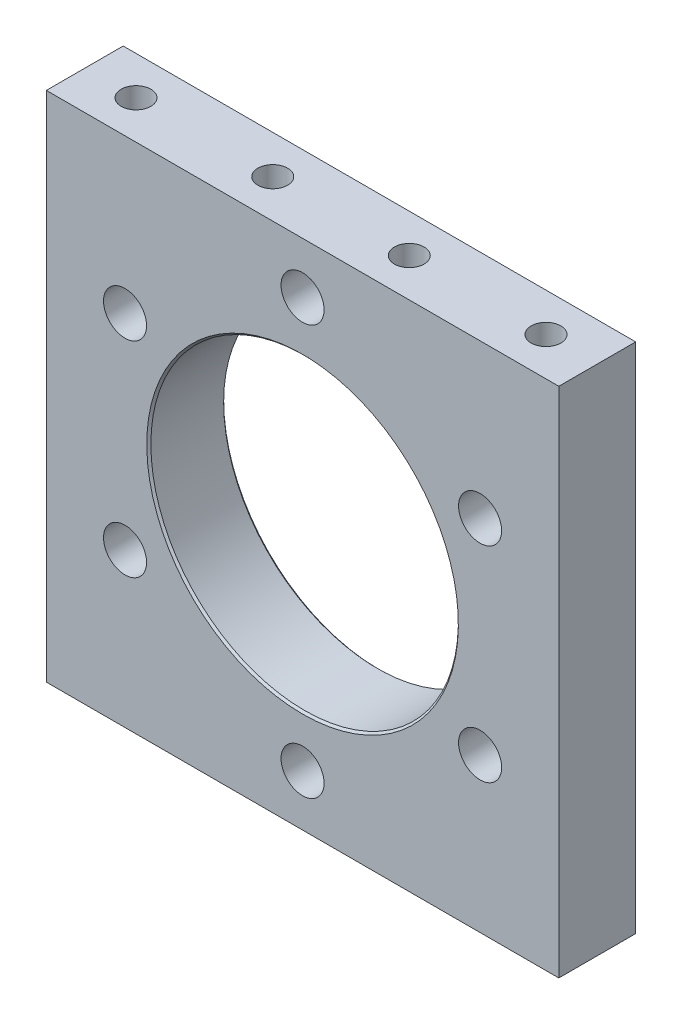
ISO-10303-21;
HEADER;
FILE_DESCRIPTION(('STEP AP214'),'2;1');
FILE_NAME('part.step','',(''),(''),'','','');
FILE_SCHEMA(('AUTOMOTIVE_DESIGN { 1 0 10303 214 1 1 1 1 }'));
ENDSEC;
DATA;
#1=APPLICATION_CONTEXT('core data for automotive mechanical design processes');
#2=APPLICATION_PROTOCOL_DEFINITION('international standard','automotive_design',2000,#1);
#3=PRODUCT_CONTEXT('',#1,'mechanical');
#4=PRODUCT('Part','Part','',(#3));
#5=PRODUCT_RELATED_PRODUCT_CATEGORY('part','',(#4));
#6=PRODUCT_DEFINITION_FORMATION('','',#4);
#7=PRODUCT_DEFINITION_CONTEXT('part definition',#1,'design');
#8=PRODUCT_DEFINITION('design','',#6,#7);
#9=PRODUCT_DEFINITION_SHAPE('','',#8);
#10=(LENGTH_UNIT() NAMED_UNIT(*) SI_UNIT(.MILLI.,.METRE.));
#11=(NAMED_UNIT(*) PLANE_ANGLE_UNIT() SI_UNIT($,.RADIAN.));
#12=(NAMED_UNIT(*) SI_UNIT($,.STERADIAN.) SOLID_ANGLE_UNIT());
#13=UNCERTAINTY_MEASURE_WITH_UNIT(LENGTH_MEASURE(1.E-05),#10,'distance_accuracy_value','');
#14=(GEOMETRIC_REPRESENTATION_CONTEXT(3) GLOBAL_UNCERTAINTY_ASSIGNED_CONTEXT((#13)) GLOBAL_UNIT_ASSIGNED_CONTEXT((#10,
#11,#12)) REPRESENTATION_CONTEXT('',''));
#15=CARTESIAN_POINT('',(0.,0.,0.));
#16=DIRECTION('',(0.,0.,1.));
#17=DIRECTION('',(1.,0.,0.));
#18=AXIS2_PLACEMENT_3D('',#15,#16,#17);
#19=CARTESIAN_POINT('',(8.28168607653656,42.2101294802246,4.7625));
#20=DIRECTION('',(0.,1.,0.));
#21=DIRECTION('',(0.,0.,1.));
#22=AXIS2_PLACEMENT_3D('',#19,#20,#21);
#23=CONICAL_SURFACE('',#22,1.84149999933648,1.02974425750932);
#24=CARTESIAN_POINT('',(8.28168607654334,41.1036446477624,4.7625));
#25=VERTEX_POINT('',#24);
#26=VERTEX_LOOP('',#25);
#27=FACE_BOUND('',#26,.T.);
#28=CARTESIAN_POINT('',(8.28168607653656,42.2101294791789,4.7625));
#29=DIRECTION('',(0.,1.,0.));
#30=DIRECTION('',(0.,0.,1.));
#31=AXIS2_PLACEMENT_3D('',#28,#29,#30);
#32=CIRCLE('',#31,1.8415);
#33=CARTESIAN_POINT('',(8.28168607653656,42.2101294791789,6.604));
#34=VERTEX_POINT('',#33);
#35=EDGE_CURVE('E84',#34,#34,#32,.T.);
#36=ORIENTED_EDGE('',*,*,#35,.T.);
#37=EDGE_LOOP('',(#36));
#38=FACE_BOUND('',#37,.T.);
#39=ADVANCED_FACE('F17',(#27,#38),#23,.F.);
#40=CARTESIAN_POINT('',(-8.63471392346345,42.2101294802246,4.7625));
#41=DIRECTION('',(0.,1.,0.));
#42=DIRECTION('',(0.,0.,1.));
#43=AXIS2_PLACEMENT_3D('',#40,#41,#42);
#44=CONICAL_SURFACE('',#43,1.84149999937962,1.02974425750932);
#45=CARTESIAN_POINT('',(-8.63471392341353,41.1036446477624,4.7625));
#46=VERTEX_POINT('',#45);
#47=VERTEX_LOOP('',#46);
#48=FACE_BOUND('',#47,.T.);
#49=CARTESIAN_POINT('',(-8.63471392346345,42.2101294791789,4.7625));
#50=DIRECTION('',(0.,1.,0.));
#51=DIRECTION('',(0.,0.,1.));
#52=AXIS2_PLACEMENT_3D('',#49,#50,#51);
#53=CIRCLE('',#52,1.8415);
#54=CARTESIAN_POINT('',(-8.63471392346345,42.2101294791789,6.604));
#55=VERTEX_POINT('',#54);
#56=EDGE_CURVE('E86',#55,#55,#53,.T.);
#57=ORIENTED_EDGE('',*,*,#56,.T.);
#58=EDGE_LOOP('',(#57));
#59=FACE_BOUND('',#58,.T.);
#60=ADVANCED_FACE('F81',(#48,#59),#44,.F.);
#61=CARTESIAN_POINT('',(-25.5765139234635,42.2101294803383,4.7625));
#62=DIRECTION('',(0.,1.,0.));
#63=DIRECTION('',(0.,0.,1.));
#64=AXIS2_PLACEMENT_3D('',#61,#62,#63);
#65=CONICAL_SURFACE('',#64,1.84149999945278,1.02974425750932);
#66=CARTESIAN_POINT('',(-25.5765139233404,41.1036446478761,4.7625));
#67=VERTEX_POINT('',#66);
#68=VERTEX_LOOP('',#67);
#69=FACE_BOUND('',#68,.T.);
#70=CARTESIAN_POINT('',(-25.5765139234635,42.2101294791789,4.7625));
#71=DIRECTION('',(0.,1.,0.));
#72=DIRECTION('',(0.,0.,1.));
#73=AXIS2_PLACEMENT_3D('',#70,#71,#72);
#74=CIRCLE('',#73,1.8415);
#75=CARTESIAN_POINT('',(-25.5765139234635,42.2101294791789,6.604));
#76=VERTEX_POINT('',#75);
#77=EDGE_CURVE('E89',#76,#76,#74,.T.);
#78=ORIENTED_EDGE('',*,*,#77,.T.);
#79=EDGE_LOOP('',(#78));
#80=FACE_BOUND('',#79,.T.);
#81=ADVANCED_FACE('F371',(#69,#80),#65,.F.);
#82=CARTESIAN_POINT('',(25.2234860765366,42.2101294802815,4.76249999999998));
#83=DIRECTION('',(0.,1.,0.));
#84=DIRECTION('',(0.,0.,1.));
#85=AXIS2_PLACEMENT_3D('',#82,#83,#84);
#86=CONICAL_SURFACE('',#85,1.84149999932016,1.02974425750017);
#87=CARTESIAN_POINT('',(25.2234860766407,41.1036446478761,4.76249999999998));
#88=VERTEX_POINT('',#87);
#89=VERTEX_LOOP('',#88);
#90=FACE_BOUND('',#89,.T.);
#91=CARTESIAN_POINT('',(25.2234860765366,42.2101294791789,4.76249999999998));
#92=DIRECTION('',(0.,1.,0.));
#93=DIRECTION('',(0.,0.,1.));
#94=AXIS2_PLACEMENT_3D('',#91,#92,#93);
#95=CIRCLE('',#94,1.8415);
#96=CARTESIAN_POINT('',(25.2234860765366,42.2101294791789,6.60399999999998));
#97=VERTEX_POINT('',#96);
#98=EDGE_CURVE('E200',#97,#97,#95,.T.);
#99=ORIENTED_EDGE('',*,*,#98,.T.);
#100=EDGE_LOOP('',(#99));
#101=FACE_BOUND('',#100,.T.);
#102=ADVANCED_FACE('F367',(#90,#101),#86,.F.);
#103=CARTESIAN_POINT('',(8.28168607653656,4.11012947807876,4.7625));
#104=DIRECTION('',(0.,-1.,0.));
#105=DIRECTION('',(0.,0.,-1.));
#106=AXIS2_PLACEMENT_3D('',#103,#104,#105);
#107=CONICAL_SURFACE('',#106,1.84149999933648,1.02974425750475);
#108=CARTESIAN_POINT('',(8.28168607665702,5.21661431048415,4.7625));
#109=VERTEX_POINT('',#108);
#110=VERTEX_LOOP('',#109);
#111=FACE_BOUND('',#110,.T.);
#112=CARTESIAN_POINT('',(8.28168607653656,4.11012947917888,4.7625));
#113=DIRECTION('',(0.,1.,0.));
#114=DIRECTION('',(0.,0.,1.));
#115=AXIS2_PLACEMENT_3D('',#112,#113,#114);
#116=CIRCLE('',#115,1.8415);
#117=CARTESIAN_POINT('',(8.28168607653656,4.11012947917888,6.604));
#118=VERTEX_POINT('',#117);
#119=EDGE_CURVE('E183',#118,#118,#116,.F.);
#120=ORIENTED_EDGE('',*,*,#119,.T.);
#121=EDGE_LOOP('',(#120));
#122=FACE_BOUND('',#121,.T.);
#123=ADVANCED_FACE('F363',(#111,#122),#107,.F.);
#124=CARTESIAN_POINT('',(-8.63471392346345,4.11012947807876,4.7625));
#125=DIRECTION('',(0.,-1.,0.));
#126=DIRECTION('',(0.,0.,-1.));
#127=AXIS2_PLACEMENT_3D('',#124,#125,#126);
#128=CONICAL_SURFACE('',#127,1.84149999937962,1.02974425744702);
#129=CARTESIAN_POINT('',(-8.63471392352722,5.21661431059783,4.7625));
#130=VERTEX_POINT('',#129);
#131=VERTEX_LOOP('',#130);
#132=FACE_BOUND('',#131,.T.);
#133=CARTESIAN_POINT('',(-8.63471392346345,4.11012947917888,4.7625));
#134=DIRECTION('',(0.,1.,0.));
#135=DIRECTION('',(0.,0.,1.));
#136=AXIS2_PLACEMENT_3D('',#133,#134,#135);
#137=CIRCLE('',#136,1.8415);
#138=CARTESIAN_POINT('',(-8.63471392346345,4.11012947917888,6.604));
#139=VERTEX_POINT('',#138);
#140=EDGE_CURVE('E218',#139,#139,#137,.F.);
#141=ORIENTED_EDGE('',*,*,#140,.T.);
#142=EDGE_LOOP('',(#141));
#143=FACE_BOUND('',#142,.T.);
#144=ADVANCED_FACE('F359',(#132,#143),#128,.F.);
#145=CARTESIAN_POINT('',(-25.5765139234635,4.1101294781356,4.7625));
#146=DIRECTION('',(0.,-1.,0.));
#147=DIRECTION('',(0.,0.,-1.));
#148=AXIS2_PLACEMENT_3D('',#145,#146,#147);
#149=CONICAL_SURFACE('',#148,1.8414999992254,1.02974425745932);
#150=CARTESIAN_POINT('',(-25.5765139235677,5.21661431059783,4.7625));
#151=VERTEX_POINT('',#150);
#152=VERTEX_LOOP('',#151);
#153=FACE_BOUND('',#152,.T.);
#154=CARTESIAN_POINT('',(-25.5765139234635,4.11012947917888,4.7625));
#155=DIRECTION('',(0.,1.,0.));
#156=DIRECTION('',(0.,0.,1.));
#157=AXIS2_PLACEMENT_3D('',#154,#155,#156);
#158=CIRCLE('',#157,1.8415);
#159=CARTESIAN_POINT('',(-25.5765139234635,4.11012947917888,6.604));
#160=VERTEX_POINT('',#159);
#161=EDGE_CURVE('E223',#160,#160,#158,.F.);
#162=ORIENTED_EDGE('',*,*,#161,.T.);
#163=EDGE_LOOP('',(#162));
#164=FACE_BOUND('',#163,.T.);
#165=ADVANCED_FACE('F352',(#153,#164),#149,.F.);
#166=CARTESIAN_POINT('',(25.2234860765366,4.1101294781356,4.76249999999998));
#167=DIRECTION('',(0.,-1.,0.));
#168=DIRECTION('',(0.,0.,-1.));
#169=AXIS2_PLACEMENT_3D('',#166,#167,#168);
#170=CONICAL_SURFACE('',#169,1.84149999926332,1.02974425750475);
#171=CARTESIAN_POINT('',(25.2234860765839,5.21661431054099,4.76249999999998));
#172=VERTEX_POINT('',#171);
#173=VERTEX_LOOP('',#172);
#174=FACE_BOUND('',#173,.T.);
#175=CARTESIAN_POINT('',(25.2234860765366,4.11012947917888,4.76249999999998));
#176=DIRECTION('',(0.,1.,0.));
#177=DIRECTION('',(0.,0.,1.));
#178=AXIS2_PLACEMENT_3D('',#175,#176,#177);
#179=CIRCLE('',#178,1.8415);
#180=CARTESIAN_POINT('',(25.2234860765366,4.11012947917888,6.60399999999998));
#181=VERTEX_POINT('',#180);
#182=EDGE_CURVE('E179',#181,#181,#179,.F.);
#183=ORIENTED_EDGE('',*,*,#182,.T.);
#184=EDGE_LOOP('',(#183));
#185=FACE_BOUND('',#184,.T.);
#186=ADVANCED_FACE('F343',(#174,#185),#170,.F.);
#187=CARTESIAN_POINT('',(-0.176513923463446,48.5601294791789,2.286));
#188=DIRECTION('',(0.,0.,-1.));
#189=DIRECTION('',(-1.,0.,0.));
#190=AXIS2_PLACEMENT_3D('',#187,#188,#189);
#191=CYLINDRICAL_SURFACE('',#190,4.7625);
#192=CARTESIAN_POINT('',(-0.176513923463446,48.5601294791789,4.572));
#193=DIRECTION('',(0.,0.,-1.));
#194=DIRECTION('',(-1.,0.,0.));
#195=AXIS2_PLACEMENT_3D('',#192,#193,#194);
#196=CIRCLE('',#195,4.7625);
#197=CARTESIAN_POINT('',(-4.93901392346345,48.5601294791789,4.572));
#198=VERTEX_POINT('',#197);
#199=EDGE_CURVE('E176',#198,#198,#196,.T.);
#200=ORIENTED_EDGE('',*,*,#199,.F.);
#201=EDGE_LOOP('',(#200));
#202=FACE_BOUND('',#201,.T.);
#203=CARTESIAN_POINT('',(-0.176513923463446,48.5601294791789,0.));
#204=DIRECTION('',(0.,0.,-1.));
#205=DIRECTION('',(-1.,0.,0.));
#206=AXIS2_PLACEMENT_3D('',#203,#204,#205);
#207=CIRCLE('',#206,4.7625);
#208=CARTESIAN_POINT('',(-4.93901392346345,48.5601294791789,0.));
#209=VERTEX_POINT('',#208);
#210=EDGE_CURVE('E20',#209,#209,#207,.T.);
#211=ORIENTED_EDGE('',*,*,#210,.T.);
#212=EDGE_LOOP('',(#211));
#213=FACE_BOUND('',#212,.T.);
#214=ADVANCED_FACE('F340',(#202,#213),#191,.F.);
#215=CARTESIAN_POINT('',(-22.1735591795882,35.8601294791789,2.286));
#216=DIRECTION('',(0.,0.,-1.));
#217=DIRECTION('',(-1.,0.,0.));
#218=AXIS2_PLACEMENT_3D('',#215,#216,#217);
#219=CYLINDRICAL_SURFACE('',#218,4.7625);
#220=CARTESIAN_POINT('',(-22.1735591795882,35.8601294791789,4.572));
#221=DIRECTION('',(0.,0.,-1.));
#222=DIRECTION('',(-1.,0.,0.));
#223=AXIS2_PLACEMENT_3D('',#220,#221,#222);
#224=CIRCLE('',#223,4.7625);
#225=CARTESIAN_POINT('',(-26.9360591795882,35.8601294791789,4.572));
#226=VERTEX_POINT('',#225);
#227=EDGE_CURVE('E173',#226,#226,#224,.T.);
#228=ORIENTED_EDGE('',*,*,#227,.F.);
#229=EDGE_LOOP('',(#228));
#230=FACE_BOUND('',#229,.T.);
#231=CARTESIAN_POINT('',(-22.1735591795882,35.8601294791789,0.));
#232=DIRECTION('',(0.,0.,-1.));
#233=DIRECTION('',(-1.,0.,0.));
#234=AXIS2_PLACEMENT_3D('',#231,#232,#233);
#235=CIRCLE('',#234,4.7625);
#236=CARTESIAN_POINT('',(-26.9360591795882,35.8601294791789,0.));
#237=VERTEX_POINT('',#236);
#238=EDGE_CURVE('E195',#237,#237,#235,.T.);
#239=ORIENTED_EDGE('',*,*,#238,.T.);
#240=EDGE_LOOP('',(#239));
#241=FACE_BOUND('',#240,.T.);
#242=ADVANCED_FACE('F342',(#230,#241),#219,.F.);
#243=CARTESIAN_POINT('',(-22.1735591795882,10.4601294791789,2.286));
#244=DIRECTION('',(0.,0.,-1.));
#245=DIRECTION('',(-1.,0.,0.));
#246=AXIS2_PLACEMENT_3D('',#243,#244,#245);
#247=CYLINDRICAL_SURFACE('',#246,4.7625);
#248=CARTESIAN_POINT('',(-22.1735591795882,10.4601294791789,4.572));
#249=DIRECTION('',(0.,0.,-1.));
#250=DIRECTION('',(-1.,0.,0.));
#251=AXIS2_PLACEMENT_3D('',#248,#249,#250);
#252=CIRCLE('',#251,4.7625);
#253=CARTESIAN_POINT('',(-26.9360591795882,10.4601294791789,4.572));
#254=VERTEX_POINT('',#253);
#255=EDGE_CURVE('E170',#254,#254,#252,.T.);
#256=ORIENTED_EDGE('',*,*,#255,.F.);
#257=EDGE_LOOP('',(#256));
#258=FACE_BOUND('',#257,.T.);
#259=CARTESIAN_POINT('',(-22.1735591795882,10.4601294791789,0.));
#260=DIRECTION('',(0.,0.,-1.));
#261=DIRECTION('',(-1.,0.,0.));
#262=AXIS2_PLACEMENT_3D('',#259,#260,#261);
#263=CIRCLE('',#262,4.7625);
#264=CARTESIAN_POINT('',(-26.9360591795882,10.4601294791789,0.));
#265=VERTEX_POINT('',#264);
#266=EDGE_CURVE('E193',#265,#265,#263,.T.);
#267=ORIENTED_EDGE('',*,*,#266,.T.);
#268=EDGE_LOOP('',(#267));
#269=FACE_BOUND('',#268,.T.);
#270=ADVANCED_FACE('F349',(#258,#269),#247,.F.);
#271=CARTESIAN_POINT('',(-0.176513923463446,-2.23987052082114,2.286));
#272=DIRECTION('',(0.,0.,-1.));
#273=DIRECTION('',(-1.,0.,0.));
#274=AXIS2_PLACEMENT_3D('',#271,#272,#273);
#275=CYLINDRICAL_SURFACE('',#274,4.7625);
#276=CARTESIAN_POINT('',(-0.176513923463446,-2.23987052082114,4.572));
#277=DIRECTION('',(0.,0.,-1.));
#278=DIRECTION('',(-1.,0.,0.));
#279=AXIS2_PLACEMENT_3D('',#276,#277,#278);
#280=CIRCLE('',#279,4.7625);
#281=CARTESIAN_POINT('',(-4.93901392346345,-2.23987052082114,4.572));
#282=VERTEX_POINT('',#281);
#283=EDGE_CURVE('E167',#282,#282,#280,.T.);
#284=ORIENTED_EDGE('',*,*,#283,.F.);
#285=EDGE_LOOP('',(#284));
#286=FACE_BOUND('',#285,.T.);
#287=CARTESIAN_POINT('',(-0.176513923463446,-2.23987052082114,0.));
#288=DIRECTION('',(0.,0.,-1.));
#289=DIRECTION('',(-1.,0.,0.));
#290=AXIS2_PLACEMENT_3D('',#287,#288,#289);
#291=CIRCLE('',#290,4.7625);
#292=CARTESIAN_POINT('',(-4.93901392346345,-2.23987052082114,0.));
#293=VERTEX_POINT('',#292);
#294=EDGE_CURVE('E190',#293,#293,#291,.T.);
#295=ORIENTED_EDGE('',*,*,#294,.T.);
#296=EDGE_LOOP('',(#295));
#297=FACE_BOUND('',#296,.T.);
#298=ADVANCED_FACE('F409',(#286,#297),#275,.F.);
#299=CARTESIAN_POINT('',(21.8205313326613,10.4601294791789,2.286));
#300=DIRECTION('',(0.,0.,-1.));
#301=DIRECTION('',(-1.,0.,0.));
#302=AXIS2_PLACEMENT_3D('',#299,#300,#301);
#303=CYLINDRICAL_SURFACE('',#302,4.7625);
#304=CARTESIAN_POINT('',(21.8205313326613,10.4601294791789,4.572));
#305=DIRECTION('',(0.,0.,-1.));
#306=DIRECTION('',(-1.,0.,0.));
#307=AXIS2_PLACEMENT_3D('',#304,#305,#306);
#308=CIRCLE('',#307,4.7625);
#309=CARTESIAN_POINT('',(17.0580313326613,10.4601294791789,4.572));
#310=VERTEX_POINT('',#309);
#311=EDGE_CURVE('E164',#310,#310,#308,.T.);
#312=ORIENTED_EDGE('',*,*,#311,.F.);
#313=EDGE_LOOP('',(#312));
#314=FACE_BOUND('',#313,.T.);
#315=CARTESIAN_POINT('',(21.8205313326613,10.4601294791789,0.));
#316=DIRECTION('',(0.,0.,-1.));
#317=DIRECTION('',(-1.,0.,0.));
#318=AXIS2_PLACEMENT_3D('',#315,#316,#317);
#319=CIRCLE('',#318,4.7625);
#320=CARTESIAN_POINT('',(17.0580313326613,10.4601294791789,0.));
#321=VERTEX_POINT('',#320);
#322=EDGE_CURVE('E187',#321,#321,#319,.T.);
#323=ORIENTED_EDGE('',*,*,#322,.T.);
#324=EDGE_LOOP('',(#323));
#325=FACE_BOUND('',#324,.T.);
#326=ADVANCED_FACE('F405',(#314,#325),#303,.F.);
#327=CARTESIAN_POINT('',(21.8205313326613,35.8601294791789,2.286));
#328=DIRECTION('',(0.,0.,-1.));
#329=DIRECTION('',(-1.,0.,0.));
#330=AXIS2_PLACEMENT_3D('',#327,#328,#329);
#331=CYLINDRICAL_SURFACE('',#330,4.7625);
#332=CARTESIAN_POINT('',(21.8205313326613,35.8601294791789,4.572));
#333=DIRECTION('',(0.,0.,-1.));
#334=DIRECTION('',(-1.,0.,0.));
#335=AXIS2_PLACEMENT_3D('',#332,#333,#334);
#336=CIRCLE('',#335,4.7625);
#337=CARTESIAN_POINT('',(17.0580313326613,35.8601294791789,4.572));
#338=VERTEX_POINT('',#337);
#339=EDGE_CURVE('E160',#338,#338,#336,.T.);
#340=ORIENTED_EDGE('',*,*,#339,.F.);
#341=EDGE_LOOP('',(#340));
#342=FACE_BOUND('',#341,.T.);
#343=CARTESIAN_POINT('',(21.8205313326613,35.8601294791789,0.));
#344=DIRECTION('',(0.,0.,-1.));
#345=DIRECTION('',(-1.,0.,0.));
#346=AXIS2_PLACEMENT_3D('',#343,#344,#345);
#347=CIRCLE('',#346,4.7625);
#348=CARTESIAN_POINT('',(17.0580313326613,35.8601294791789,0.));
#349=VERTEX_POINT('',#348);
#350=EDGE_CURVE('E184',#349,#349,#347,.T.);
#351=ORIENTED_EDGE('',*,*,#350,.T.);
#352=EDGE_LOOP('',(#351));
#353=FACE_BOUND('',#352,.T.);
#354=ADVANCED_FACE('F398',(#342,#353),#331,.F.);
#355=CARTESIAN_POINT('',(-0.17651392346342,23.1601294791789,-1.13986592517254E-10));
#356=DIRECTION('',(0.,0.,-1.));
#357=DIRECTION('',(-1.,0.,0.));
#358=AXIS2_PLACEMENT_3D('',#355,#356,#357);
#359=CONICAL_SURFACE('',#358,19.303999999886,0.785398162500011);
#360=CARTESIAN_POINT('',(-0.17651392346342,23.1601294791789,-1.13986890672851E-10));
#361=DIRECTION('',(0.,0.,-1.));
#362=DIRECTION('',(-1.,0.,0.));
#363=AXIS2_PLACEMENT_3D('',#360,#361,#362);
#364=CIRCLE('',#363,19.303999999886);
#365=CARTESIAN_POINT('',(-19.4805139233495,23.1601294791789,-1.13986890672851E-10));
#366=VERTEX_POINT('',#365);
#367=EDGE_CURVE('E180',#366,#366,#364,.T.);
#368=ORIENTED_EDGE('',*,*,#367,.T.);
#369=EDGE_LOOP('',(#368));
#370=FACE_BOUND('',#369,.T.);
#371=CARTESIAN_POINT('',(-0.176513923463421,23.1601294791789,0.254000000000004));
#372=DIRECTION('',(0.,0.,1.));
#373=DIRECTION('',(1.,0.,0.));
#374=AXIS2_PLACEMENT_3D('',#371,#372,#373);
#375=CIRCLE('',#374,19.05);
#376=CARTESIAN_POINT('',(18.8734860765366,23.1601294791789,0.254000000000004));
#377=VERTEX_POINT('',#376);
#378=EDGE_CURVE('E163',#377,#377,#375,.T.);
#379=ORIENTED_EDGE('',*,*,#378,.T.);
#380=EDGE_LOOP('',(#379));
#381=FACE_BOUND('',#380,.T.);
#382=ADVANCED_FACE('F393',(#370,#381),#359,.F.);
#383=CARTESIAN_POINT('',(8.28168607653656,48.5601294791789,4.7625));
#384=DIRECTION('',(0.,1.,0.));
#385=DIRECTION('',(0.,0.,1.));
#386=AXIS2_PLACEMENT_3D('',#383,#384,#385);
#387=CYLINDRICAL_SURFACE('',#386,1.8415);
#388=ORIENTED_EDGE('',*,*,#35,.F.);
#389=EDGE_LOOP('',(#388));
#390=FACE_BOUND('',#389,.T.);
#391=CARTESIAN_POINT('',(8.28168607653656,54.9101294791789,4.7625));
#392=DIRECTION('',(0.,1.,0.));
#393=DIRECTION('',(0.,0.,1.));
#394=AXIS2_PLACEMENT_3D('',#391,#392,#393);
#395=CIRCLE('',#394,1.8415);
#396=CARTESIAN_POINT('',(8.28168607653656,54.9101294791789,6.604));
#397=VERTEX_POINT('',#396);
#398=EDGE_CURVE('E156',#397,#397,#395,.F.);
#399=ORIENTED_EDGE('',*,*,#398,.F.);
#400=EDGE_LOOP('',(#399));
#401=FACE_BOUND('',#400,.T.);
#402=ADVANCED_FACE('F385',(#390,#401),#387,.F.);
#403=CARTESIAN_POINT('',(-8.63471392346345,48.5601294791789,4.7625));
#404=DIRECTION('',(0.,1.,0.));
#405=DIRECTION('',(0.,0.,1.));
#406=AXIS2_PLACEMENT_3D('',#403,#404,#405);
#407=CYLINDRICAL_SURFACE('',#406,1.8415);
#408=ORIENTED_EDGE('',*,*,#56,.F.);
#409=EDGE_LOOP('',(#408));
#410=FACE_BOUND('',#409,.T.);
#411=CARTESIAN_POINT('',(-8.63471392346345,54.9101294791789,4.7625));
#412=DIRECTION('',(0.,1.,0.));
#413=DIRECTION('',(0.,0.,1.));
#414=AXIS2_PLACEMENT_3D('',#411,#412,#413);
#415=CIRCLE('',#414,1.8415);
#416=CARTESIAN_POINT('',(-8.63471392346345,54.9101294791789,6.604));
#417=VERTEX_POINT('',#416);
#418=EDGE_CURVE('E153',#417,#417,#415,.F.);
#419=ORIENTED_EDGE('',*,*,#418,.F.);
#420=EDGE_LOOP('',(#419));
#421=FACE_BOUND('',#420,.T.);
#422=ADVANCED_FACE('F381',(#410,#421),#407,.F.);
#423=CARTESIAN_POINT('',(-25.5765139234635,48.5601294791789,4.7625));
#424=DIRECTION('',(0.,1.,0.));
#425=DIRECTION('',(0.,0.,1.));
#426=AXIS2_PLACEMENT_3D('',#423,#424,#425);
#427=CYLINDRICAL_SURFACE('',#426,1.8415);
#428=ORIENTED_EDGE('',*,*,#77,.F.);
#429=EDGE_LOOP('',(#428));
#430=FACE_BOUND('',#429,.T.);
#431=CARTESIAN_POINT('',(-25.5765139234635,54.9101294791789,4.7625));
#432=DIRECTION('',(0.,1.,0.));
#433=DIRECTION('',(0.,0.,1.));
#434=AXIS2_PLACEMENT_3D('',#431,#432,#433);
#435=CIRCLE('',#434,1.8415);
#436=CARTESIAN_POINT('',(-25.5765139234635,54.9101294791789,6.604));
#437=VERTEX_POINT('',#436);
#438=EDGE_CURVE('E150',#437,#437,#435,.F.);
#439=ORIENTED_EDGE('',*,*,#438,.F.);
#440=EDGE_LOOP('',(#439));
#441=FACE_BOUND('',#440,.T.);
#442=ADVANCED_FACE('F384',(#430,#441),#427,.F.);
#443=CARTESIAN_POINT('',(25.2234860765366,48.5601294791789,4.76249999999998));
#444=DIRECTION('',(0.,1.,0.));
#445=DIRECTION('',(0.,0.,1.));
#446=AXIS2_PLACEMENT_3D('',#443,#444,#445);
#447=CYLINDRICAL_SURFACE('',#446,1.8415);
#448=ORIENTED_EDGE('',*,*,#98,.F.);
#449=EDGE_LOOP('',(#448));
#450=FACE_BOUND('',#449,.T.);
#451=CARTESIAN_POINT('',(25.2234860765366,54.9101294791789,4.76249999999998));
#452=DIRECTION('',(0.,1.,0.));
#453=DIRECTION('',(0.,0.,1.));
#454=AXIS2_PLACEMENT_3D('',#451,#452,#453);
#455=CIRCLE('',#454,1.8415);
#456=CARTESIAN_POINT('',(25.2234860765366,54.9101294791789,6.60399999999998));
#457=VERTEX_POINT('',#456);
#458=EDGE_CURVE('E146',#457,#457,#455,.F.);
#459=ORIENTED_EDGE('',*,*,#458,.F.);
#460=EDGE_LOOP('',(#459));
#461=FACE_BOUND('',#460,.T.);
#462=ADVANCED_FACE('F425',(#450,#461),#447,.F.);
#463=CARTESIAN_POINT('',(-0.176513923463446,23.1601294791789,0.));
#464=DIRECTION('',(0.,0.,1.));
#465=DIRECTION('',(1.,0.,0.));
#466=AXIS2_PLACEMENT_3D('',#463,#464,#465);
#467=PLANE('',#466);
#468=ORIENTED_EDGE('',*,*,#367,.F.);
#469=EDGE_LOOP('',(#468));
#470=FACE_BOUND('',#469,.T.);
#471=ORIENTED_EDGE('',*,*,#350,.F.);
#472=EDGE_LOOP('',(#471));
#473=FACE_BOUND('',#472,.T.);
#474=ORIENTED_EDGE('',*,*,#322,.F.);
#475=EDGE_LOOP('',(#474));
#476=FACE_BOUND('',#475,.T.);
#477=ORIENTED_EDGE('',*,*,#294,.F.);
#478=EDGE_LOOP('',(#477));
#479=FACE_BOUND('',#478,.T.);
#480=ORIENTED_EDGE('',*,*,#266,.F.);
#481=EDGE_LOOP('',(#480));
#482=FACE_BOUND('',#481,.T.);
#483=ORIENTED_EDGE('',*,*,#238,.F.);
#484=EDGE_LOOP('',(#483));
#485=FACE_BOUND('',#484,.T.);
#486=ORIENTED_EDGE('',*,*,#210,.F.);
#487=EDGE_LOOP('',(#486));
#488=FACE_BOUND('',#487,.T.);
#489=DIRECTION('',(0.,1.,0.));
#490=VECTOR('',#489,1.);
#491=CARTESIAN_POINT('',(31.5734860765366,54.9101294791789,0.));
#492=LINE('',#491,#490);
#493=CARTESIAN_POINT('',(31.5734860765366,-8.58987052082112,0.));
#494=VERTEX_POINT('',#493);
#495=CARTESIAN_POINT('',(31.5734860765366,54.9101294791789,0.));
#496=VERTEX_POINT('',#495);
#497=EDGE_CURVE('E236',#494,#496,#492,.T.);
#498=ORIENTED_EDGE('',*,*,#497,.F.);
#499=DIRECTION('',(1.,0.,0.));
#500=VECTOR('',#499,1.);
#501=CARTESIAN_POINT('',(31.5734860765366,-8.58987052082112,0.));
#502=LINE('',#501,#500);
#503=CARTESIAN_POINT('',(-31.9265139234634,-8.58987052082112,0.));
#504=VERTEX_POINT('',#503);
#505=EDGE_CURVE('E247',#504,#494,#502,.T.);
#506=ORIENTED_EDGE('',*,*,#505,.F.);
#507=DIRECTION('',(0.,1.,0.));
#508=VECTOR('',#507,1.);
#509=CARTESIAN_POINT('',(-31.9265139234634,-8.58987052082112,0.));
#510=LINE('',#509,#508);
#511=CARTESIAN_POINT('',(-31.9265139234634,54.9101294791789,0.));
#512=VERTEX_POINT('',#511);
#513=EDGE_CURVE('E244',#512,#504,#510,.F.);
#514=ORIENTED_EDGE('',*,*,#513,.F.);
#515=DIRECTION('',(1.,0.,0.));
#516=VECTOR('',#515,1.);
#517=CARTESIAN_POINT('',(-31.9265139234634,54.9101294791789,0.));
#518=LINE('',#517,#516);
#519=EDGE_CURVE('E159',#496,#512,#518,.F.);
#520=ORIENTED_EDGE('',*,*,#519,.F.);
#521=EDGE_LOOP('',(#498,#506,#514,#520));
#522=FACE_BOUND('',#521,.T.);
#523=ADVANCED_FACE('F421',(#470,#473,#476,#479,#482,#485,#488,#522),#467,.F.);
#524=CARTESIAN_POINT('',(8.28168607653656,-2.23987052082112,4.7625));
#525=DIRECTION('',(0.,1.,0.));
#526=DIRECTION('',(0.,0.,1.));
#527=AXIS2_PLACEMENT_3D('',#524,#525,#526);
#528=CYLINDRICAL_SURFACE('',#527,1.8415);
#529=ORIENTED_EDGE('',*,*,#119,.F.);
#530=EDGE_LOOP('',(#529));
#531=FACE_BOUND('',#530,.T.);
#532=CARTESIAN_POINT('',(8.28168607653656,-8.58987052082112,4.7625));
#533=DIRECTION('',(0.,1.,0.));
#534=DIRECTION('',(0.,0.,1.));
#535=AXIS2_PLACEMENT_3D('',#532,#533,#534);
#536=CIRCLE('',#535,1.8415);
#537=CARTESIAN_POINT('',(8.28168607653656,-8.58987052082112,6.604));
#538=VERTEX_POINT('',#537);
#539=EDGE_CURVE('E142',#538,#538,#536,.T.);
#540=ORIENTED_EDGE('',*,*,#539,.F.);
#541=EDGE_LOOP('',(#540));
#542=FACE_BOUND('',#541,.T.);
#543=ADVANCED_FACE('F424',(#531,#542),#528,.F.);
#544=CARTESIAN_POINT('',(-8.63471392346345,-2.23987052082112,4.7625));
#545=DIRECTION('',(0.,1.,0.));
#546=DIRECTION('',(0.,0.,1.));
#547=AXIS2_PLACEMENT_3D('',#544,#545,#546);
#548=CYLINDRICAL_SURFACE('',#547,1.8415);
#549=ORIENTED_EDGE('',*,*,#140,.F.);
#550=EDGE_LOOP('',(#549));
#551=FACE_BOUND('',#550,.T.);
#552=CARTESIAN_POINT('',(-8.63471392346345,-8.58987052082112,4.7625));
#553=DIRECTION('',(0.,1.,0.));
#554=DIRECTION('',(0.,0.,1.));
#555=AXIS2_PLACEMENT_3D('',#552,#553,#554);
#556=CIRCLE('',#555,1.8415);
#557=CARTESIAN_POINT('',(-8.63471392346345,-8.58987052082112,6.604));
#558=VERTEX_POINT('',#557);
#559=EDGE_CURVE('E139',#558,#558,#556,.T.);
#560=ORIENTED_EDGE('',*,*,#559,.F.);
#561=EDGE_LOOP('',(#560));
#562=FACE_BOUND('',#561,.T.);
#563=ADVANCED_FACE('F434',(#551,#562),#548,.F.);
#564=CARTESIAN_POINT('',(-25.5765139234635,-2.23987052082112,4.7625));
#565=DIRECTION('',(0.,1.,0.));
#566=DIRECTION('',(0.,0.,1.));
#567=AXIS2_PLACEMENT_3D('',#564,#565,#566);
#568=CYLINDRICAL_SURFACE('',#567,1.8415);
#569=ORIENTED_EDGE('',*,*,#161,.F.);
#570=EDGE_LOOP('',(#569));
#571=FACE_BOUND('',#570,.T.);
#572=CARTESIAN_POINT('',(-25.5765139234635,-8.58987052082112,4.7625));
#573=DIRECTION('',(0.,1.,0.));
#574=DIRECTION('',(0.,0.,1.));
#575=AXIS2_PLACEMENT_3D('',#572,#573,#574);
#576=CIRCLE('',#575,1.8415);
#577=CARTESIAN_POINT('',(-25.5765139234635,-8.58987052082112,6.604));
#578=VERTEX_POINT('',#577);
#579=EDGE_CURVE('E136',#578,#578,#576,.T.);
#580=ORIENTED_EDGE('',*,*,#579,.F.);
#581=EDGE_LOOP('',(#580));
#582=FACE_BOUND('',#581,.T.);
#583=ADVANCED_FACE('F481',(#571,#582),#568,.F.);
#584=CARTESIAN_POINT('',(25.2234860765366,-2.23987052082112,4.76249999999998));
#585=DIRECTION('',(0.,1.,0.));
#586=DIRECTION('',(0.,0.,1.));
#587=AXIS2_PLACEMENT_3D('',#584,#585,#586);
#588=CYLINDRICAL_SURFACE('',#587,1.8415);
#589=ORIENTED_EDGE('',*,*,#182,.F.);
#590=EDGE_LOOP('',(#589));
#591=FACE_BOUND('',#590,.T.);
#592=CARTESIAN_POINT('',(25.2234860765366,-8.58987052082112,4.76249999999998));
#593=DIRECTION('',(0.,1.,0.));
#594=DIRECTION('',(0.,0.,1.));
#595=AXIS2_PLACEMENT_3D('',#592,#593,#594);
#596=CIRCLE('',#595,1.8415);
#597=CARTESIAN_POINT('',(25.2234860765366,-8.58987052082112,6.60399999999998));
#598=VERTEX_POINT('',#597);
#599=EDGE_CURVE('E133',#598,#598,#596,.T.);
#600=ORIENTED_EDGE('',*,*,#599,.F.);
#601=EDGE_LOOP('',(#600));
#602=FACE_BOUND('',#601,.T.);
#603=ADVANCED_FACE('F336',(#591,#602),#588,.F.);
#604=CARTESIAN_POINT('',(-0.176513923463446,48.5601294791789,4.572));
#605=DIRECTION('',(0.,0.,-1.));
#606=DIRECTION('',(-1.,0.,0.));
#607=AXIS2_PLACEMENT_3D('',#604,#605,#606);
#608=PLANE('',#607);
#609=CARTESIAN_POINT('',(-0.176513923463446,48.5601294791789,4.572));
#610=DIRECTION('',(0.,0.,-1.));
#611=DIRECTION('',(-1.,0.,0.));
#612=AXIS2_PLACEMENT_3D('',#609,#610,#611);
#613=CIRCLE('',#612,2.667);
#614=CARTESIAN_POINT('',(-2.84351392346345,48.5601294791789,4.572));
#615=VERTEX_POINT('',#614);
#616=EDGE_CURVE('E130',#615,#615,#613,.F.);
#617=ORIENTED_EDGE('',*,*,#616,.T.);
#618=EDGE_LOOP('',(#617));
#619=FACE_BOUND('',#618,.T.);
#620=ORIENTED_EDGE('',*,*,#199,.T.);
#621=EDGE_LOOP('',(#620));
#622=FACE_BOUND('',#621,.T.);
#623=ADVANCED_FACE('F332',(#619,#622),#608,.T.);
#624=CARTESIAN_POINT('',(-22.1735591795882,35.8601294791789,4.572));
#625=DIRECTION('',(0.,0.,-1.));
#626=DIRECTION('',(-1.,0.,0.));
#627=AXIS2_PLACEMENT_3D('',#624,#625,#626);
#628=PLANE('',#627);
#629=CARTESIAN_POINT('',(-22.1735591795882,35.8601294791789,4.572));
#630=DIRECTION('',(0.,0.,-1.));
#631=DIRECTION('',(-1.,0.,0.));
#632=AXIS2_PLACEMENT_3D('',#629,#630,#631);
#633=CIRCLE('',#632,2.667);
#634=CARTESIAN_POINT('',(-24.8405591795882,35.8601294791789,4.572));
#635=VERTEX_POINT('',#634);
#636=EDGE_CURVE('E127',#635,#635,#633,.F.);
#637=ORIENTED_EDGE('',*,*,#636,.T.);
#638=EDGE_LOOP('',(#637));
#639=FACE_BOUND('',#638,.T.);
#640=ORIENTED_EDGE('',*,*,#227,.T.);
#641=EDGE_LOOP('',(#640));
#642=FACE_BOUND('',#641,.T.);
#643=ADVANCED_FACE('F335',(#639,#642),#628,.T.);
#644=CARTESIAN_POINT('',(-22.1735591795882,10.4601294791789,4.572));
#645=DIRECTION('',(0.,0.,-1.));
#646=DIRECTION('',(-1.,0.,0.));
#647=AXIS2_PLACEMENT_3D('',#644,#645,#646);
#648=PLANE('',#647);
#649=CARTESIAN_POINT('',(-22.1735591795882,10.4601294791789,4.572));
#650=DIRECTION('',(0.,0.,-1.));
#651=DIRECTION('',(-1.,0.,0.));
#652=AXIS2_PLACEMENT_3D('',#649,#650,#651);
#653=CIRCLE('',#652,2.667);
#654=CARTESIAN_POINT('',(-24.8405591795882,10.4601294791789,4.572));
#655=VERTEX_POINT('',#654);
#656=EDGE_CURVE('E124',#655,#655,#653,.F.);
#657=ORIENTED_EDGE('',*,*,#656,.T.);
#658=EDGE_LOOP('',(#657));
#659=FACE_BOUND('',#658,.T.);
#660=ORIENTED_EDGE('',*,*,#255,.T.);
#661=EDGE_LOOP('',(#660));
#662=FACE_BOUND('',#661,.T.);
#663=ADVANCED_FACE('F514',(#659,#662),#648,.T.);
#664=CARTESIAN_POINT('',(-0.176513923463446,-2.23987052082114,4.572));
#665=DIRECTION('',(0.,0.,-1.));
#666=DIRECTION('',(-1.,0.,0.));
#667=AXIS2_PLACEMENT_3D('',#664,#665,#666);
#668=PLANE('',#667);
#669=CARTESIAN_POINT('',(-0.176513923463446,-2.23987052082114,4.572));
#670=DIRECTION('',(0.,0.,-1.));
#671=DIRECTION('',(-1.,0.,0.));
#672=AXIS2_PLACEMENT_3D('',#669,#670,#671);
#673=CIRCLE('',#672,2.667);
#674=CARTESIAN_POINT('',(-2.84351392346345,-2.23987052082114,4.572));
#675=VERTEX_POINT('',#674);
#676=EDGE_CURVE('E121',#675,#675,#673,.F.);
#677=ORIENTED_EDGE('',*,*,#676,.T.);
#678=EDGE_LOOP('',(#677));
#679=FACE_BOUND('',#678,.T.);
#680=ORIENTED_EDGE('',*,*,#283,.T.);
#681=EDGE_LOOP('',(#680));
#682=FACE_BOUND('',#681,.T.);
#683=ADVANCED_FACE('F524',(#679,#682),#668,.T.);
#684=CARTESIAN_POINT('',(21.8205313326613,10.4601294791789,4.572));
#685=DIRECTION('',(0.,0.,-1.));
#686=DIRECTION('',(-1.,0.,0.));
#687=AXIS2_PLACEMENT_3D('',#684,#685,#686);
#688=PLANE('',#687);
#689=CARTESIAN_POINT('',(21.8205313326613,10.4601294791789,4.572));
#690=DIRECTION('',(0.,0.,-1.));
#691=DIRECTION('',(-1.,0.,0.));
#692=AXIS2_PLACEMENT_3D('',#689,#690,#691);
#693=CIRCLE('',#692,2.667);
#694=CARTESIAN_POINT('',(19.1535313326613,10.4601294791789,4.572));
#695=VERTEX_POINT('',#694);
#696=EDGE_CURVE('E118',#695,#695,#693,.F.);
#697=ORIENTED_EDGE('',*,*,#696,.T.);
#698=EDGE_LOOP('',(#697));
#699=FACE_BOUND('',#698,.T.);
#700=ORIENTED_EDGE('',*,*,#311,.T.);
#701=EDGE_LOOP('',(#700));
#702=FACE_BOUND('',#701,.T.);
#703=ADVANCED_FACE('F534',(#699,#702),#688,.T.);
#704=CARTESIAN_POINT('',(21.8205313326613,35.8601294791789,4.572));
#705=DIRECTION('',(0.,0.,-1.));
#706=DIRECTION('',(-1.,0.,0.));
#707=AXIS2_PLACEMENT_3D('',#704,#705,#706);
#708=PLANE('',#707);
#709=CARTESIAN_POINT('',(21.8205313326613,35.8601294791789,4.572));
#710=DIRECTION('',(0.,0.,-1.));
#711=DIRECTION('',(-1.,0.,0.));
#712=AXIS2_PLACEMENT_3D('',#709,#710,#711);
#713=CIRCLE('',#712,2.667);
#714=CARTESIAN_POINT('',(19.1535313326613,35.8601294791789,4.572));
#715=VERTEX_POINT('',#714);
#716=EDGE_CURVE('E114',#715,#715,#713,.F.);
#717=ORIENTED_EDGE('',*,*,#716,.T.);
#718=EDGE_LOOP('',(#717));
#719=FACE_BOUND('',#718,.T.);
#720=ORIENTED_EDGE('',*,*,#339,.T.);
#721=EDGE_LOOP('',(#720));
#722=FACE_BOUND('',#721,.T.);
#723=ADVANCED_FACE('F544',(#719,#722),#708,.T.);
#724=CARTESIAN_POINT('',(-0.176513923463421,23.1601294791789,-80.7812878486321));
#725=DIRECTION('',(0.,0.,1.));
#726=DIRECTION('',(1.,0.,0.));
#727=AXIS2_PLACEMENT_3D('',#724,#725,#726);
#728=CYLINDRICAL_SURFACE('',#727,19.05);
#729=CARTESIAN_POINT('',(-0.176513923463421,23.1601294791789,9.27099999988603));
#730=DIRECTION('',(0.,0.,1.));
#731=DIRECTION('',(-1.,0.,0.));
#732=AXIS2_PLACEMENT_3D('',#729,#730,#731);
#733=CIRCLE('',#732,19.050000000114);
#734=CARTESIAN_POINT('',(-19.2265139235774,23.1601294791789,9.27099999988603));
#735=VERTEX_POINT('',#734);
#736=EDGE_CURVE('E117',#735,#735,#733,.T.);
#737=ORIENTED_EDGE('',*,*,#736,.T.);
#738=EDGE_LOOP('',(#737));
#739=FACE_BOUND('',#738,.T.);
#740=ORIENTED_EDGE('',*,*,#378,.F.);
#741=EDGE_LOOP('',(#740));
#742=FACE_BOUND('',#741,.T.);
#743=ADVANCED_FACE('F554',(#739,#742),#728,.F.);
#744=CARTESIAN_POINT('',(31.5734860765366,54.9101294791789,0.));
#745=DIRECTION('',(1.,0.,0.));
#746=DIRECTION('',(0.,0.,-1.));
#747=AXIS2_PLACEMENT_3D('',#744,#745,#746);
#748=PLANE('',#747);
#749=ORIENTED_EDGE('',*,*,#497,.T.);
#750=DIRECTION('',(0.,0.,1.));
#751=VECTOR('',#750,1.);
#752=CARTESIAN_POINT('',(31.5734860765366,54.9101294791789,0.));
#753=LINE('',#752,#751);
#754=CARTESIAN_POINT('',(31.5734860765366,54.9101294791789,9.525));
#755=VERTEX_POINT('',#754);
#756=EDGE_CURVE('E238',#755,#496,#753,.F.);
#757=ORIENTED_EDGE('',*,*,#756,.F.);
#758=DIRECTION('',(0.,1.,0.));
#759=VECTOR('',#758,1.);
#760=CARTESIAN_POINT('',(31.5734860765366,23.1601294791789,9.525));
#761=LINE('',#760,#759);
#762=CARTESIAN_POINT('',(31.5734860765366,-8.58987052082112,9.525));
#763=VERTEX_POINT('',#762);
#764=EDGE_CURVE('E256',#763,#755,#761,.T.);
#765=ORIENTED_EDGE('',*,*,#764,.F.);
#766=DIRECTION('',(0.,0.,-1.));
#767=VECTOR('',#766,1.);
#768=CARTESIAN_POINT('',(31.5734860765366,-8.58987052082112,0.));
#769=LINE('',#768,#767);
#770=EDGE_CURVE('E145',#494,#763,#769,.F.);
#771=ORIENTED_EDGE('',*,*,#770,.F.);
#772=EDGE_LOOP('',(#749,#757,#765,#771));
#773=FACE_BOUND('',#772,.T.);
#774=ADVANCED_FACE('F273',(#773),#748,.T.);
#775=CARTESIAN_POINT('',(-31.9265139234634,54.9101294791789,0.));
#776=DIRECTION('',(0.,1.,0.));
#777=DIRECTION('',(0.,0.,1.));
#778=AXIS2_PLACEMENT_3D('',#775,#776,#777);
#779=PLANE('',#778);
#780=ORIENTED_EDGE('',*,*,#458,.T.);
#781=EDGE_LOOP('',(#780));
#782=FACE_BOUND('',#781,.T.);
#783=ORIENTED_EDGE('',*,*,#438,.T.);
#784=EDGE_LOOP('',(#783));
#785=FACE_BOUND('',#784,.T.);
#786=ORIENTED_EDGE('',*,*,#418,.T.);
#787=EDGE_LOOP('',(#786));
#788=FACE_BOUND('',#787,.T.);
#789=ORIENTED_EDGE('',*,*,#398,.T.);
#790=EDGE_LOOP('',(#789));
#791=FACE_BOUND('',#790,.T.);
#792=ORIENTED_EDGE('',*,*,#519,.T.);
#793=DIRECTION('',(0.,0.,1.));
#794=VECTOR('',#793,1.);
#795=CARTESIAN_POINT('',(-31.9265139234634,54.9101294791789,0.));
#796=LINE('',#795,#794);
#797=CARTESIAN_POINT('',(-31.9265139234634,54.9101294791789,9.525));
#798=VERTEX_POINT('',#797);
#799=EDGE_CURVE('E149',#798,#512,#796,.F.);
#800=ORIENTED_EDGE('',*,*,#799,.F.);
#801=DIRECTION('',(1.,0.,0.));
#802=VECTOR('',#801,1.);
#803=CARTESIAN_POINT('',(-0.176513923463446,54.9101294791789,9.525));
#804=LINE('',#803,#802);
#805=EDGE_CURVE('E259',#755,#798,#804,.F.);
#806=ORIENTED_EDGE('',*,*,#805,.F.);
#807=ORIENTED_EDGE('',*,*,#756,.T.);
#808=EDGE_LOOP('',(#792,#800,#806,#807));
#809=FACE_BOUND('',#808,.T.);
#810=ADVANCED_FACE('F277',(#782,#785,#788,#791,#809),#779,.T.);
#811=CARTESIAN_POINT('',(-31.9265139234634,-8.58987052082112,0.));
#812=DIRECTION('',(-1.,0.,0.));
#813=DIRECTION('',(0.,0.,1.));
#814=AXIS2_PLACEMENT_3D('',#811,#812,#813);
#815=PLANE('',#814);
#816=ORIENTED_EDGE('',*,*,#513,.T.);
#817=DIRECTION('',(0.,0.,-1.));
#818=VECTOR('',#817,1.);
#819=CARTESIAN_POINT('',(-31.9265139234634,-8.58987052082112,0.));
#820=LINE('',#819,#818);
#821=CARTESIAN_POINT('',(-31.9265139234634,-8.58987052082112,9.525));
#822=VERTEX_POINT('',#821);
#823=EDGE_CURVE('E35',#822,#504,#820,.T.);
#824=ORIENTED_EDGE('',*,*,#823,.F.);
#825=DIRECTION('',(0.,1.,0.));
#826=VECTOR('',#825,1.);
#827=CARTESIAN_POINT('',(-31.9265139234634,23.1601294791789,9.525));
#828=LINE('',#827,#826);
#829=EDGE_CURVE('E262',#798,#822,#828,.F.);
#830=ORIENTED_EDGE('',*,*,#829,.F.);
#831=ORIENTED_EDGE('',*,*,#799,.T.);
#832=EDGE_LOOP('',(#816,#824,#830,#831));
#833=FACE_BOUND('',#832,.T.);
#834=ADVANCED_FACE('F279',(#833),#815,.T.);
#835=CARTESIAN_POINT('',(31.5734860765366,-8.58987052082112,0.));
#836=DIRECTION('',(0.,-1.,0.));
#837=DIRECTION('',(0.,0.,-1.));
#838=AXIS2_PLACEMENT_3D('',#835,#836,#837);
#839=PLANE('',#838);
#840=ORIENTED_EDGE('',*,*,#599,.T.);
#841=EDGE_LOOP('',(#840));
#842=FACE_BOUND('',#841,.T.);
#843=ORIENTED_EDGE('',*,*,#579,.T.);
#844=EDGE_LOOP('',(#843));
#845=FACE_BOUND('',#844,.T.);
#846=ORIENTED_EDGE('',*,*,#559,.T.);
#847=EDGE_LOOP('',(#846));
#848=FACE_BOUND('',#847,.T.);
#849=ORIENTED_EDGE('',*,*,#539,.T.);
#850=EDGE_LOOP('',(#849));
#851=FACE_BOUND('',#850,.T.);
#852=ORIENTED_EDGE('',*,*,#505,.T.);
#853=ORIENTED_EDGE('',*,*,#770,.T.);
#854=DIRECTION('',(1.,0.,0.));
#855=VECTOR('',#854,1.);
#856=CARTESIAN_POINT('',(-0.176513923463446,-8.58987052082112,9.525));
#857=LINE('',#856,#855);
#858=EDGE_CURVE('E113',#822,#763,#857,.T.);
#859=ORIENTED_EDGE('',*,*,#858,.F.);
#860=ORIENTED_EDGE('',*,*,#823,.T.);
#861=EDGE_LOOP('',(#852,#853,#859,#860));
#862=FACE_BOUND('',#861,.T.);
#863=ADVANCED_FACE('F269',(#842,#845,#848,#851,#862),#839,.T.);
#864=CARTESIAN_POINT('',(-0.176513923463446,48.5601294791789,12.7));
#865=DIRECTION('',(0.,0.,-1.));
#866=DIRECTION('',(-1.,0.,0.));
#867=AXIS2_PLACEMENT_3D('',#864,#865,#866);
#868=CYLINDRICAL_SURFACE('',#867,2.667);
#869=ORIENTED_EDGE('',*,*,#616,.F.);
#870=EDGE_LOOP('',(#869));
#871=FACE_BOUND('',#870,.T.);
#872=CARTESIAN_POINT('',(-0.176513923463446,48.5601294791789,9.525));
#873=DIRECTION('',(0.,0.,-1.));
#874=DIRECTION('',(-1.,0.,0.));
#875=AXIS2_PLACEMENT_3D('',#872,#873,#874);
#876=CIRCLE('',#875,2.667);
#877=CARTESIAN_POINT('',(-2.84351392346345,48.5601294791789,9.525));
#878=VERTEX_POINT('',#877);
#879=EDGE_CURVE('E110',#878,#878,#876,.T.);
#880=ORIENTED_EDGE('',*,*,#879,.F.);
#881=EDGE_LOOP('',(#880));
#882=FACE_BOUND('',#881,.T.);
#883=ADVANCED_FACE('F287',(#871,#882),#868,.F.);
#884=CARTESIAN_POINT('',(-22.1735591795882,35.8601294791789,12.7));
#885=DIRECTION('',(0.,0.,-1.));
#886=DIRECTION('',(-1.,0.,0.));
#887=AXIS2_PLACEMENT_3D('',#884,#885,#886);
#888=CYLINDRICAL_SURFACE('',#887,2.667);
#889=ORIENTED_EDGE('',*,*,#636,.F.);
#890=EDGE_LOOP('',(#889));
#891=FACE_BOUND('',#890,.T.);
#892=CARTESIAN_POINT('',(-22.1735591795882,35.8601294791789,9.525));
#893=DIRECTION('',(0.,0.,-1.));
#894=DIRECTION('',(-1.,0.,0.));
#895=AXIS2_PLACEMENT_3D('',#892,#893,#894);
#896=CIRCLE('',#895,2.667);
#897=CARTESIAN_POINT('',(-24.8405591795882,35.8601294791789,9.525));
#898=VERTEX_POINT('',#897);
#899=EDGE_CURVE('E107',#898,#898,#896,.T.);
#900=ORIENTED_EDGE('',*,*,#899,.F.);
#901=EDGE_LOOP('',(#900));
#902=FACE_BOUND('',#901,.T.);
#903=ADVANCED_FACE('F318',(#891,#902),#888,.F.);
#904=CARTESIAN_POINT('',(-22.1735591795882,10.4601294791789,12.7));
#905=DIRECTION('',(0.,0.,-1.));
#906=DIRECTION('',(-1.,0.,0.));
#907=AXIS2_PLACEMENT_3D('',#904,#905,#906);
#908=CYLINDRICAL_SURFACE('',#907,2.667);
#909=ORIENTED_EDGE('',*,*,#656,.F.);
#910=EDGE_LOOP('',(#909));
#911=FACE_BOUND('',#910,.T.);
#912=CARTESIAN_POINT('',(-22.1735591795882,10.4601294791789,9.525));
#913=DIRECTION('',(0.,0.,-1.));
#914=DIRECTION('',(-1.,0.,0.));
#915=AXIS2_PLACEMENT_3D('',#912,#913,#914);
#916=CIRCLE('',#915,2.667);
#917=CARTESIAN_POINT('',(-24.8405591795882,10.4601294791789,9.525));
#918=VERTEX_POINT('',#917);
#919=EDGE_CURVE('E104',#918,#918,#916,.T.);
#920=ORIENTED_EDGE('',*,*,#919,.F.);
#921=EDGE_LOOP('',(#920));
#922=FACE_BOUND('',#921,.T.);
#923=ADVANCED_FACE('F314',(#911,#922),#908,.F.);
#924=CARTESIAN_POINT('',(-0.176513923463446,-2.23987052082114,12.7));
#925=DIRECTION('',(0.,0.,-1.));
#926=DIRECTION('',(-1.,0.,0.));
#927=AXIS2_PLACEMENT_3D('',#924,#925,#926);
#928=CYLINDRICAL_SURFACE('',#927,2.667);
#929=ORIENTED_EDGE('',*,*,#676,.F.);
#930=EDGE_LOOP('',(#929));
#931=FACE_BOUND('',#930,.T.);
#932=CARTESIAN_POINT('',(-0.176513923463446,-2.23987052082114,9.525));
#933=DIRECTION('',(0.,0.,-1.));
#934=DIRECTION('',(-1.,0.,0.));
#935=AXIS2_PLACEMENT_3D('',#932,#933,#934);
#936=CIRCLE('',#935,2.667);
#937=CARTESIAN_POINT('',(-2.84351392346345,-2.23987052082114,9.525));
#938=VERTEX_POINT('',#937);
#939=EDGE_CURVE('E101',#938,#938,#936,.T.);
#940=ORIENTED_EDGE('',*,*,#939,.F.);
#941=EDGE_LOOP('',(#940));
#942=FACE_BOUND('',#941,.T.);
#943=ADVANCED_FACE('F310',(#931,#942),#928,.F.);
#944=CARTESIAN_POINT('',(21.8205313326613,10.4601294791789,12.7));
#945=DIRECTION('',(0.,0.,-1.));
#946=DIRECTION('',(-1.,0.,0.));
#947=AXIS2_PLACEMENT_3D('',#944,#945,#946);
#948=CYLINDRICAL_SURFACE('',#947,2.667);
#949=ORIENTED_EDGE('',*,*,#696,.F.);
#950=EDGE_LOOP('',(#949));
#951=FACE_BOUND('',#950,.T.);
#952=CARTESIAN_POINT('',(21.8205313326613,10.4601294791789,9.525));
#953=DIRECTION('',(0.,0.,-1.));
#954=DIRECTION('',(-1.,0.,0.));
#955=AXIS2_PLACEMENT_3D('',#952,#953,#954);
#956=CIRCLE('',#955,2.667);
#957=CARTESIAN_POINT('',(19.1535313326613,10.4601294791789,9.525));
#958=VERTEX_POINT('',#957);
#959=EDGE_CURVE('E98',#958,#958,#956,.T.);
#960=ORIENTED_EDGE('',*,*,#959,.F.);
#961=EDGE_LOOP('',(#960));
#962=FACE_BOUND('',#961,.T.);
#963=ADVANCED_FACE('F306',(#951,#962),#948,.F.);
#964=CARTESIAN_POINT('',(21.8205313326613,35.8601294791789,12.7));
#965=DIRECTION('',(0.,0.,-1.));
#966=DIRECTION('',(-1.,0.,0.));
#967=AXIS2_PLACEMENT_3D('',#964,#965,#966);
#968=CYLINDRICAL_SURFACE('',#967,2.667);
#969=ORIENTED_EDGE('',*,*,#716,.F.);
#970=EDGE_LOOP('',(#969));
#971=FACE_BOUND('',#970,.T.);
#972=CARTESIAN_POINT('',(21.8205313326613,35.8601294791789,9.525));
#973=DIRECTION('',(0.,0.,-1.));
#974=DIRECTION('',(-1.,0.,0.));
#975=AXIS2_PLACEMENT_3D('',#972,#973,#974);
#976=CIRCLE('',#975,2.667);
#977=CARTESIAN_POINT('',(19.1535313326613,35.8601294791789,9.525));
#978=VERTEX_POINT('',#977);
#979=EDGE_CURVE('E26',#978,#978,#976,.T.);
#980=ORIENTED_EDGE('',*,*,#979,.F.);
#981=EDGE_LOOP('',(#980));
#982=FACE_BOUND('',#981,.T.);
#983=ADVANCED_FACE('F299',(#971,#982),#968,.F.);
#984=CARTESIAN_POINT('',(-0.17651392346342,23.1601294791789,9.52500000011397));
#985=DIRECTION('',(0.,0.,1.));
#986=DIRECTION('',(0.,-1.,0.));
#987=AXIS2_PLACEMENT_3D('',#984,#985,#986);
#988=CONICAL_SURFACE('',#987,19.303999999886,0.785398162500026);
#989=CARTESIAN_POINT('',(-0.17651392346342,23.1601294791789,9.52500000011397));
#990=DIRECTION('',(0.,0.,1.));
#991=DIRECTION('',(0.,-1.,0.));
#992=AXIS2_PLACEMENT_3D('',#989,#990,#991);
#993=CIRCLE('',#992,19.303999999886);
#994=CARTESIAN_POINT('',(-0.17651392346342,3.85612947929285,9.52500000011397));
#995=VERTEX_POINT('',#994);
#996=EDGE_CURVE('E11',#995,#995,#993,.F.);
#997=ORIENTED_EDGE('',*,*,#996,.F.);
#998=EDGE_LOOP('',(#997));
#999=FACE_BOUND('',#998,.T.);
#1000=ORIENTED_EDGE('',*,*,#736,.F.);
#1001=EDGE_LOOP('',(#1000));
#1002=FACE_BOUND('',#1001,.T.);
#1003=ADVANCED_FACE('F293',(#999,#1002),#988,.F.);
#1004=CARTESIAN_POINT('',(-0.176513923463446,23.1601294791789,9.525));
#1005=DIRECTION('',(0.,0.,1.));
#1006=DIRECTION('',(1.,0.,0.));
#1007=AXIS2_PLACEMENT_3D('',#1004,#1005,#1006);
#1008=PLANE('',#1007);
#1009=ORIENTED_EDGE('',*,*,#996,.T.);
#1010=EDGE_LOOP('',(#1009));
#1011=FACE_BOUND('',#1010,.T.);
#1012=ORIENTED_EDGE('',*,*,#979,.T.);
#1013=EDGE_LOOP('',(#1012));
#1014=FACE_BOUND('',#1013,.T.);
#1015=ORIENTED_EDGE('',*,*,#959,.T.);
#1016=EDGE_LOOP('',(#1015));
#1017=FACE_BOUND('',#1016,.T.);
#1018=ORIENTED_EDGE('',*,*,#939,.T.);
#1019=EDGE_LOOP('',(#1018));
#1020=FACE_BOUND('',#1019,.T.);
#1021=ORIENTED_EDGE('',*,*,#919,.T.);
#1022=EDGE_LOOP('',(#1021));
#1023=FACE_BOUND('',#1022,.T.);
#1024=ORIENTED_EDGE('',*,*,#899,.T.);
#1025=EDGE_LOOP('',(#1024));
#1026=FACE_BOUND('',#1025,.T.);
#1027=ORIENTED_EDGE('',*,*,#879,.T.);
#1028=EDGE_LOOP('',(#1027));
#1029=FACE_BOUND('',#1028,.T.);
#1030=ORIENTED_EDGE('',*,*,#829,.T.);
#1031=ORIENTED_EDGE('',*,*,#858,.T.);
#1032=ORIENTED_EDGE('',*,*,#764,.T.);
#1033=ORIENTED_EDGE('',*,*,#805,.T.);
#1034=EDGE_LOOP('',(#1030,#1031,#1032,#1033));
#1035=FACE_BOUND('',#1034,.T.);
#1036=ADVANCED_FACE('F267',(#1011,#1014,#1017,#1020,#1023,#1026,#1029,#1035),#1008,.T.);
#1037=CLOSED_SHELL('',(#39,#60,#81,#102,#123,#144,#165,#186,#214,#242,#270,#298,#326,#354,#382,
#402,#422,#442,#462,#523,#543,#563,#583,#603,#623,#643,#663,#683,#703,#723,#743,#774,#810,#834,
#863,#883,#903,#923,#943,#963,#983,#1003,#1036));
#1038=MANIFOLD_SOLID_BREP('B1',#1037);
#1039=ADVANCED_BREP_SHAPE_REPRESENTATION('',(#18,#1038),#14);
#1040=SHAPE_DEFINITION_REPRESENTATION(#9,#1039);
ENDSEC;
END-ISO-10303-21;
